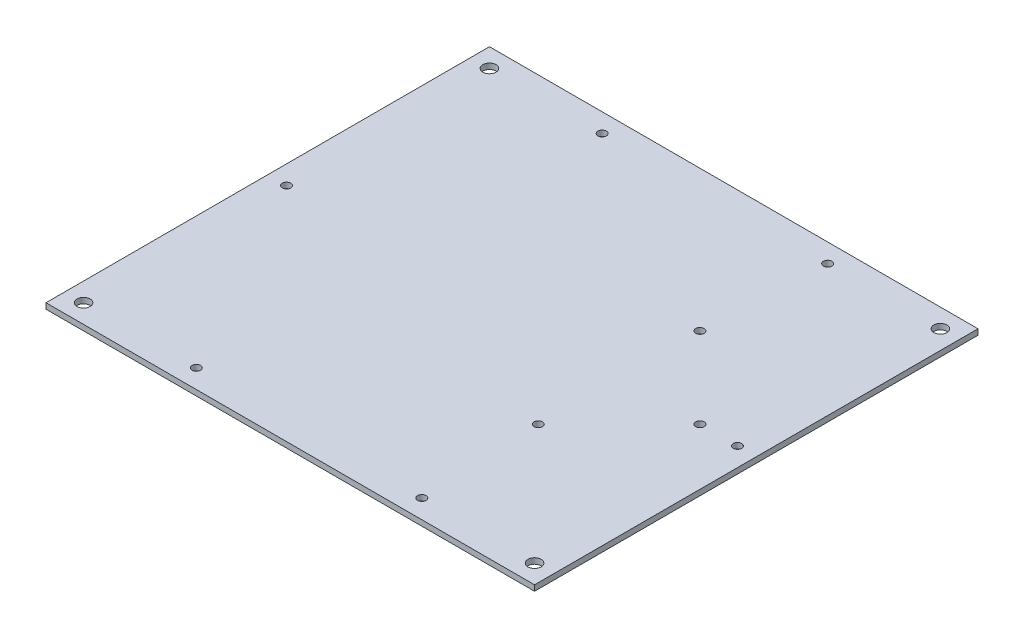
ISO-10303-21;
HEADER;
FILE_DESCRIPTION(('STEP AP214'),'2;1');
FILE_NAME('part.step','',(''),(''),'','','');
FILE_SCHEMA(('AUTOMOTIVE_DESIGN { 1 0 10303 214 1 1 1 1 }'));
ENDSEC;
DATA;
#1=APPLICATION_CONTEXT('core data for automotive mechanical design processes');
#2=APPLICATION_PROTOCOL_DEFINITION('international standard','automotive_design',2000,#1);
#3=PRODUCT_CONTEXT('',#1,'mechanical');
#4=PRODUCT('Part','Part','',(#3));
#5=PRODUCT_RELATED_PRODUCT_CATEGORY('part','',(#4));
#6=PRODUCT_DEFINITION_FORMATION('','',#4);
#7=PRODUCT_DEFINITION_CONTEXT('part definition',#1,'design');
#8=PRODUCT_DEFINITION('design','',#6,#7);
#9=PRODUCT_DEFINITION_SHAPE('','',#8);
#10=(LENGTH_UNIT() NAMED_UNIT(*) SI_UNIT(.MILLI.,.METRE.));
#11=(NAMED_UNIT(*) PLANE_ANGLE_UNIT() SI_UNIT($,.RADIAN.));
#12=(NAMED_UNIT(*) SI_UNIT($,.STERADIAN.) SOLID_ANGLE_UNIT());
#13=UNCERTAINTY_MEASURE_WITH_UNIT(LENGTH_MEASURE(1.E-05),#10,'distance_accuracy_value','');
#14=(GEOMETRIC_REPRESENTATION_CONTEXT(3) GLOBAL_UNCERTAINTY_ASSIGNED_CONTEXT((#13)) GLOBAL_UNIT_ASSIGNED_CONTEXT((#10,
#11,#12)) REPRESENTATION_CONTEXT('',''));
#15=CARTESIAN_POINT('',(0.,0.,0.));
#16=DIRECTION('',(0.,0.,1.));
#17=DIRECTION('',(1.,0.,0.));
#18=AXIS2_PLACEMENT_3D('',#15,#16,#17);
#19=CARTESIAN_POINT('',(41.0208009797823,-3.00000000000013,216.072268450656));
#20=DIRECTION('',(0.,0.,-1.));
#21=DIRECTION('',(0.,1.,0.));
#22=AXIS2_PLACEMENT_3D('',#19,#20,#21);
#23=PLANE('',#22);
#24=DIRECTION('',(-1.,0.,0.));
#25=VECTOR('',#24,1.);
#26=CARTESIAN_POINT('',(41.0208009797823,-1.33947758048002E-13,216.072268450656));
#27=LINE('',#26,#25);
#28=CARTESIAN_POINT('',(41.0208009797823,-1.33947758048002E-13,216.072268450656));
#29=VERTEX_POINT('',#28);
#30=CARTESIAN_POINT('',(-218.979199020218,7.15046319606531E-13,216.072268450656));
#31=VERTEX_POINT('',#30);
#32=EDGE_CURVE('E98',#29,#31,#27,.T.);
#33=ORIENTED_EDGE('',*,*,#32,.T.);
#34=DIRECTION('',(0.,1.,0.));
#35=VECTOR('',#34,1.);
#36=CARTESIAN_POINT('',(-218.979199020218,-2.99999999999929,216.072268450656));
#37=LINE('',#36,#35);
#38=CARTESIAN_POINT('',(-218.979199020218,-2.99999999999929,216.072268450656));
#39=VERTEX_POINT('',#38);
#40=EDGE_CURVE('E11',#39,#31,#37,.T.);
#41=ORIENTED_EDGE('',*,*,#40,.F.);
#42=DIRECTION('',(-1.,0.,0.));
#43=VECTOR('',#42,1.);
#44=CARTESIAN_POINT('',(41.0208009797823,-3.00000000000013,216.072268450656));
#45=LINE('',#44,#43);
#46=CARTESIAN_POINT('',(41.0208009797823,-3.00000000000013,216.072268450656));
#47=VERTEX_POINT('',#46);
#48=EDGE_CURVE('E86',#47,#39,#45,.T.);
#49=ORIENTED_EDGE('',*,*,#48,.F.);
#50=DIRECTION('',(0.,1.,0.));
#51=VECTOR('',#50,1.);
#52=CARTESIAN_POINT('',(41.0208009797823,-3.00000000000013,216.072268450656));
#53=LINE('',#52,#51);
#54=EDGE_CURVE('E94',#47,#29,#53,.T.);
#55=ORIENTED_EDGE('',*,*,#54,.T.);
#56=EDGE_LOOP('',(#33,#41,#49,#55));
#57=FACE_BOUND('',#56,.T.);
#58=ADVANCED_FACE('F35',(#57),#23,.F.);
#59=CARTESIAN_POINT('',(-218.979199020218,-2.99999999999929,216.072268450656));
#60=DIRECTION('',(1.,0.,0.));
#61=DIRECTION('',(0.,1.,0.));
#62=AXIS2_PLACEMENT_3D('',#59,#60,#61);
#63=PLANE('',#62);
#64=DIRECTION('',(0.,0.,-1.));
#65=VECTOR('',#64,1.);
#66=CARTESIAN_POINT('',(-218.979199020218,7.15046319606531E-13,216.072268450656));
#67=LINE('',#66,#65);
#68=CARTESIAN_POINT('',(-218.979199020218,7.1504631960653E-13,-19.9277315493439));
#69=VERTEX_POINT('',#68);
#70=EDGE_CURVE('E90',#31,#69,#67,.T.);
#71=ORIENTED_EDGE('',*,*,#70,.T.);
#72=DIRECTION('',(0.,1.,0.));
#73=VECTOR('',#72,1.);
#74=CARTESIAN_POINT('',(-218.979199020218,-2.99999999999929,-19.9277315493439));
#75=LINE('',#74,#73);
#76=CARTESIAN_POINT('',(-218.979199020218,-2.99999999999929,-19.9277315493439));
#77=VERTEX_POINT('',#76);
#78=EDGE_CURVE('E43',#77,#69,#75,.T.);
#79=ORIENTED_EDGE('',*,*,#78,.F.);
#80=DIRECTION('',(0.,0.,-1.));
#81=VECTOR('',#80,1.);
#82=CARTESIAN_POINT('',(-218.979199020218,-2.99999999999929,216.072268450656));
#83=LINE('',#82,#81);
#84=EDGE_CURVE('E81',#39,#77,#83,.T.);
#85=ORIENTED_EDGE('',*,*,#84,.F.);
#86=ORIENTED_EDGE('',*,*,#40,.T.);
#87=EDGE_LOOP('',(#71,#79,#85,#86));
#88=FACE_BOUND('',#87,.T.);
#89=ADVANCED_FACE('F89',(#88),#63,.F.);
#90=CARTESIAN_POINT('',(-218.979199020218,-2.99999999999929,-19.9277315493439));
#91=DIRECTION('',(0.,0.,1.));
#92=DIRECTION('',(1.,0.,0.));
#93=AXIS2_PLACEMENT_3D('',#90,#91,#92);
#94=PLANE('',#93);
#95=DIRECTION('',(1.,0.,0.));
#96=VECTOR('',#95,1.);
#97=CARTESIAN_POINT('',(-218.979199020218,7.1504631960653E-13,-19.9277315493439));
#98=LINE('',#97,#96);
#99=CARTESIAN_POINT('',(41.0208009797731,-1.33947758047971E-13,-19.9277315493437));
#100=VERTEX_POINT('',#99);
#101=EDGE_CURVE('E68',#69,#100,#98,.T.);
#102=ORIENTED_EDGE('',*,*,#101,.T.);
#103=DIRECTION('',(0.,1.,0.));
#104=VECTOR('',#103,1.);
#105=CARTESIAN_POINT('',(41.0208009797731,-3.00000000000013,-19.9277315493437));
#106=LINE('',#105,#104);
#107=CARTESIAN_POINT('',(41.0208009797731,-3.00000000000013,-19.9277315493437));
#108=VERTEX_POINT('',#107);
#109=EDGE_CURVE('E91',#108,#100,#106,.T.);
#110=ORIENTED_EDGE('',*,*,#109,.F.);
#111=DIRECTION('',(1.,0.,0.));
#112=VECTOR('',#111,1.);
#113=CARTESIAN_POINT('',(-218.979199020218,-2.99999999999929,-19.9277315493439));
#114=LINE('',#113,#112);
#115=EDGE_CURVE('E84',#77,#108,#114,.T.);
#116=ORIENTED_EDGE('',*,*,#115,.F.);
#117=ORIENTED_EDGE('',*,*,#78,.T.);
#118=EDGE_LOOP('',(#102,#110,#116,#117));
#119=FACE_BOUND('',#118,.T.);
#120=ADVANCED_FACE('F92',(#119),#94,.F.);
#121=CARTESIAN_POINT('',(41.0208009797731,-3.00000000000013,-19.9277315493437));
#122=DIRECTION('',(-1.,0.,0.));
#123=DIRECTION('',(0.,0.,1.));
#124=AXIS2_PLACEMENT_3D('',#121,#122,#123);
#125=PLANE('',#124);
#126=DIRECTION('',(0.,0.,1.));
#127=VECTOR('',#126,1.);
#128=CARTESIAN_POINT('',(41.0208009797731,-1.33947758047971E-13,-19.9277315493437));
#129=LINE('',#128,#127);
#130=EDGE_CURVE('E74',#100,#29,#129,.T.);
#131=ORIENTED_EDGE('',*,*,#130,.T.);
#132=ORIENTED_EDGE('',*,*,#54,.F.);
#133=DIRECTION('',(0.,0.,1.));
#134=VECTOR('',#133,1.);
#135=CARTESIAN_POINT('',(41.0208009797731,-3.00000000000013,-19.9277315493437));
#136=LINE('',#135,#134);
#137=EDGE_CURVE('E51',#108,#47,#136,.T.);
#138=ORIENTED_EDGE('',*,*,#137,.F.);
#139=ORIENTED_EDGE('',*,*,#109,.T.);
#140=EDGE_LOOP('',(#131,#132,#138,#139));
#141=FACE_BOUND('',#140,.T.);
#142=ADVANCED_FACE('F106',(#141),#125,.F.);
#143=CARTESIAN_POINT('',(0.,-3.,0.));
#144=DIRECTION('',(0.,-1.,0.));
#145=DIRECTION('',(1.,0.,0.));
#146=AXIS2_PLACEMENT_3D('',#143,#144,#145);
#147=PLANE('',#146);
#148=CARTESIAN_POINT('',(-31.9791990202268,-3.00000000000074,55.0722684506571));
#149=DIRECTION('',(0.,1.,0.));
#150=DIRECTION('',(-1.,0.,0.));
#151=AXIS2_PLACEMENT_3D('',#148,#149,#150);
#152=CIRCLE('',#151,2.25);
#153=CARTESIAN_POINT('',(-34.2291990202268,-3.00000000000074,55.0722684506571));
#154=VERTEX_POINT('',#153);
#155=EDGE_CURVE('E181',#154,#154,#152,.T.);
#156=ORIENTED_EDGE('',*,*,#155,.T.);
#157=EDGE_LOOP('',(#156));
#158=FACE_BOUND('',#157,.T.);
#159=CARTESIAN_POINT('',(11.0208009797732,-3.00000000000089,98.0722684506568));
#160=DIRECTION('',(0.,1.,0.));
#161=DIRECTION('',(-1.,0.,0.));
#162=AXIS2_PLACEMENT_3D('',#159,#160,#161);
#163=CIRCLE('',#162,2.25);
#164=CARTESIAN_POINT('',(8.77080097977317,-3.00000000000088,98.0722684506568));
#165=VERTEX_POINT('',#164);
#166=EDGE_CURVE('E175',#165,#165,#163,.T.);
#167=ORIENTED_EDGE('',*,*,#166,.T.);
#168=EDGE_LOOP('',(#167));
#169=FACE_BOUND('',#168,.T.);
#170=CARTESIAN_POINT('',(-31.9791990202268,-3.00000000000074,141.072268450657));
#171=DIRECTION('',(0.,1.,0.));
#172=DIRECTION('',(-1.,0.,0.));
#173=AXIS2_PLACEMENT_3D('',#170,#171,#172);
#174=CIRCLE('',#173,2.25);
#175=CARTESIAN_POINT('',(-34.2291990202268,-3.00000000000074,141.072268450657));
#176=VERTEX_POINT('',#175);
#177=EDGE_CURVE('E169',#176,#176,#174,.T.);
#178=ORIENTED_EDGE('',*,*,#177,.T.);
#179=EDGE_LOOP('',(#178));
#180=FACE_BOUND('',#179,.T.);
#181=CARTESIAN_POINT('',(31.0208009797823,-3.0000000000001,206.072268450656));
#182=DIRECTION('',(0.,-1.,0.));
#183=DIRECTION('',(1.,0.,0.));
#184=AXIS2_PLACEMENT_3D('',#181,#182,#183);
#185=CIRCLE('',#184,3.5);
#186=CARTESIAN_POINT('',(34.5208009797823,-3.00000000000011,206.072268450656));
#187=VERTEX_POINT('',#186);
#188=EDGE_CURVE('E166',#187,#187,#185,.T.);
#189=ORIENTED_EDGE('',*,*,#188,.F.);
#190=EDGE_LOOP('',(#189));
#191=FACE_BOUND('',#190,.T.);
#192=CARTESIAN_POINT('',(31.0208009797815,-3.0000000000001,-9.92773154934397));
#193=DIRECTION('',(0.,-1.,0.));
#194=DIRECTION('',(1.,0.,0.));
#195=AXIS2_PLACEMENT_3D('',#192,#193,#194);
#196=CIRCLE('',#195,3.5);
#197=CARTESIAN_POINT('',(34.5208009797815,-3.00000000000011,-9.92773154934397));
#198=VERTEX_POINT('',#197);
#199=EDGE_CURVE('E160',#198,#198,#196,.T.);
#200=ORIENTED_EDGE('',*,*,#199,.F.);
#201=EDGE_LOOP('',(#200));
#202=FACE_BOUND('',#201,.T.);
#203=CARTESIAN_POINT('',(-208.979199020218,-2.99999999999932,206.072268450656));
#204=DIRECTION('',(0.,-1.,0.));
#205=DIRECTION('',(1.,0.,0.));
#206=AXIS2_PLACEMENT_3D('',#203,#204,#205);
#207=CIRCLE('',#206,3.50000000000002);
#208=CARTESIAN_POINT('',(-205.479199020218,-2.99999999999933,206.072268450656));
#209=VERTEX_POINT('',#208);
#210=EDGE_CURVE('E154',#209,#209,#207,.T.);
#211=ORIENTED_EDGE('',*,*,#210,.F.);
#212=EDGE_LOOP('',(#211));
#213=FACE_BOUND('',#212,.T.);
#214=CARTESIAN_POINT('',(-208.979199020217,-2.99999999999932,-9.92773154934397));
#215=DIRECTION('',(0.,-1.,0.));
#216=DIRECTION('',(1.,0.,0.));
#217=AXIS2_PLACEMENT_3D('',#214,#215,#216);
#218=CIRCLE('',#217,3.50000000000002);
#219=CARTESIAN_POINT('',(-205.479199020217,-2.99999999999933,-9.92773154934397));
#220=VERTEX_POINT('',#219);
#221=EDGE_CURVE('E148',#220,#220,#218,.T.);
#222=ORIENTED_EDGE('',*,*,#221,.F.);
#223=EDGE_LOOP('',(#222));
#224=FACE_BOUND('',#223,.T.);
#225=CARTESIAN_POINT('',(-148.979199020218,-2.99999999999951,206.072268450656));
#226=DIRECTION('',(0.,-1.,0.));
#227=DIRECTION('',(1.,0.,0.));
#228=AXIS2_PLACEMENT_3D('',#225,#226,#227);
#229=CIRCLE('',#228,2.24999999999995);
#230=CARTESIAN_POINT('',(-146.729199020218,-2.99999999999952,206.072268450656));
#231=VERTEX_POINT('',#230);
#232=EDGE_CURVE('E142',#231,#231,#229,.T.);
#233=ORIENTED_EDGE('',*,*,#232,.F.);
#234=EDGE_LOOP('',(#233));
#235=FACE_BOUND('',#234,.T.);
#236=CARTESIAN_POINT('',(-28.9791990202177,-2.99999999999991,206.072268450656));
#237=DIRECTION('',(0.,-1.,0.));
#238=DIRECTION('',(1.,0.,0.));
#239=AXIS2_PLACEMENT_3D('',#236,#237,#238);
#240=CIRCLE('',#239,2.25);
#241=CARTESIAN_POINT('',(-26.7291990202177,-2.99999999999991,206.072268450656));
#242=VERTEX_POINT('',#241);
#243=EDGE_CURVE('E136',#242,#242,#240,.T.);
#244=ORIENTED_EDGE('',*,*,#243,.F.);
#245=EDGE_LOOP('',(#244));
#246=FACE_BOUND('',#245,.T.);
#247=CARTESIAN_POINT('',(31.0208009797823,-3.0000000000001,98.0722684506568));
#248=DIRECTION('',(0.,-1.,0.));
#249=DIRECTION('',(1.,0.,0.));
#250=AXIS2_PLACEMENT_3D('',#247,#248,#249);
#251=CIRCLE('',#250,2.25000000000001);
#252=CARTESIAN_POINT('',(33.2708009797823,-3.00000000000011,98.0722684506568));
#253=VERTEX_POINT('',#252);
#254=EDGE_CURVE('E130',#253,#253,#251,.T.);
#255=ORIENTED_EDGE('',*,*,#254,.F.);
#256=EDGE_LOOP('',(#255));
#257=FACE_BOUND('',#256,.T.);
#258=CARTESIAN_POINT('',(-28.9791990202185,-2.99999999999991,-9.92773154934397));
#259=DIRECTION('',(0.,-1.,0.));
#260=DIRECTION('',(1.,0.,0.));
#261=AXIS2_PLACEMENT_3D('',#258,#259,#260);
#262=CIRCLE('',#261,2.25);
#263=CARTESIAN_POINT('',(-26.7291990202185,-2.99999999999991,-9.92773154934397));
#264=VERTEX_POINT('',#263);
#265=EDGE_CURVE('E124',#264,#264,#262,.T.);
#266=ORIENTED_EDGE('',*,*,#265,.F.);
#267=EDGE_LOOP('',(#266));
#268=FACE_BOUND('',#267,.T.);
#269=CARTESIAN_POINT('',(-148.979199020217,-2.99999999999951,-9.9277315493427));
#270=DIRECTION('',(0.,-1.,0.));
#271=DIRECTION('',(1.,0.,0.));
#272=AXIS2_PLACEMENT_3D('',#269,#270,#271);
#273=CIRCLE('',#272,2.24999999999995);
#274=CARTESIAN_POINT('',(-146.729199020218,-2.99999999999952,-9.9277315493427));
#275=VERTEX_POINT('',#274);
#276=EDGE_CURVE('E118',#275,#275,#273,.T.);
#277=ORIENTED_EDGE('',*,*,#276,.F.);
#278=EDGE_LOOP('',(#277));
#279=FACE_BOUND('',#278,.T.);
#280=CARTESIAN_POINT('',(-208.979199020218,-2.99999999999932,98.0722684506568));
#281=DIRECTION('',(0.,-1.,0.));
#282=DIRECTION('',(1.,0.,0.));
#283=AXIS2_PLACEMENT_3D('',#280,#281,#282);
#284=CIRCLE('',#283,2.24999999999995);
#285=CARTESIAN_POINT('',(-206.729199020218,-2.99999999999933,98.0722684506568));
#286=VERTEX_POINT('',#285);
#287=EDGE_CURVE('E112',#286,#286,#284,.T.);
#288=ORIENTED_EDGE('',*,*,#287,.F.);
#289=EDGE_LOOP('',(#288));
#290=FACE_BOUND('',#289,.T.);
#291=ORIENTED_EDGE('',*,*,#48,.T.);
#292=ORIENTED_EDGE('',*,*,#84,.T.);
#293=ORIENTED_EDGE('',*,*,#115,.T.);
#294=ORIENTED_EDGE('',*,*,#137,.T.);
#295=EDGE_LOOP('',(#291,#292,#293,#294));
#296=FACE_BOUND('',#295,.T.);
#297=ADVANCED_FACE('F82',(#158,#169,#180,#191,#202,#213,#224,#235,#246,#257,#268,#279,#290,
#296),#147,.T.);
#298=CARTESIAN_POINT('',(0.,0.,0.));
#299=DIRECTION('',(0.,-1.,0.));
#300=DIRECTION('',(1.,0.,0.));
#301=AXIS2_PLACEMENT_3D('',#298,#299,#300);
#302=PLANE('',#301);
#303=CARTESIAN_POINT('',(-31.9791990202268,1.04423656062724E-13,55.0722684506571));
#304=DIRECTION('',(0.,1.,0.));
#305=DIRECTION('',(-1.,0.,0.));
#306=AXIS2_PLACEMENT_3D('',#303,#304,#305);
#307=CIRCLE('',#306,2.25);
#308=CARTESIAN_POINT('',(-34.2291990202268,1.11770720196273E-13,55.0722684506571));
#309=VERTEX_POINT('',#308);
#310=EDGE_CURVE('E184',#309,#309,#307,.T.);
#311=ORIENTED_EDGE('',*,*,#310,.F.);
#312=EDGE_LOOP('',(#311));
#313=FACE_BOUND('',#312,.T.);
#314=CARTESIAN_POINT('',(11.0208009797732,0.,98.0722684506568));
#315=DIRECTION('',(0.,1.,0.));
#316=DIRECTION('',(-1.,0.,0.));
#317=AXIS2_PLACEMENT_3D('',#314,#315,#316);
#318=CIRCLE('',#317,2.25);
#319=CARTESIAN_POINT('',(8.77080097977318,0.,98.0722684506568));
#320=VERTEX_POINT('',#319);
#321=EDGE_CURVE('E178',#320,#320,#318,.T.);
#322=ORIENTED_EDGE('',*,*,#321,.F.);
#323=EDGE_LOOP('',(#322));
#324=FACE_BOUND('',#323,.T.);
#325=CARTESIAN_POINT('',(-31.9791990202268,1.04423656062724E-13,141.072268450657));
#326=DIRECTION('',(0.,1.,0.));
#327=DIRECTION('',(-1.,0.,0.));
#328=AXIS2_PLACEMENT_3D('',#325,#326,#327);
#329=CIRCLE('',#328,2.25);
#330=CARTESIAN_POINT('',(-34.2291990202268,1.11770720196272E-13,141.072268450657));
#331=VERTEX_POINT('',#330);
#332=EDGE_CURVE('E172',#331,#331,#329,.T.);
#333=ORIENTED_EDGE('',*,*,#332,.F.);
#334=EDGE_LOOP('',(#333));
#335=FACE_BOUND('',#334,.T.);
#336=CARTESIAN_POINT('',(31.0208009797823,7.47665818146004E-13,206.072268450656));
#337=DIRECTION('',(0.,-1.,0.));
#338=DIRECTION('',(1.,0.,0.));
#339=AXIS2_PLACEMENT_3D('',#336,#337,#338);
#340=CIRCLE('',#339,3.5);
#341=CARTESIAN_POINT('',(34.5208009797823,7.36237051716039E-13,206.072268450656));
#342=VERTEX_POINT('',#341);
#343=EDGE_CURVE('E163',#342,#342,#340,.T.);
#344=ORIENTED_EDGE('',*,*,#343,.T.);
#345=EDGE_LOOP('',(#344));
#346=FACE_BOUND('',#345,.T.);
#347=CARTESIAN_POINT('',(31.0208009797815,7.47665818146004E-13,-9.92773154934397));
#348=DIRECTION('',(0.,-1.,0.));
#349=DIRECTION('',(1.,0.,0.));
#350=AXIS2_PLACEMENT_3D('',#347,#348,#349);
#351=CIRCLE('',#350,3.5);
#352=CARTESIAN_POINT('',(34.5208009797815,7.36237051716039E-13,-9.92773154934397));
#353=VERTEX_POINT('',#352);
#354=EDGE_CURVE('E157',#353,#353,#351,.T.);
#355=ORIENTED_EDGE('',*,*,#354,.T.);
#356=EDGE_LOOP('',(#355));
#357=FACE_BOUND('',#356,.T.);
#358=CARTESIAN_POINT('',(-208.979199020218,1.53132714841853E-12,206.072268450656));
#359=DIRECTION('',(0.,-1.,0.));
#360=DIRECTION('',(1.,0.,0.));
#361=AXIS2_PLACEMENT_3D('',#358,#359,#360);
#362=CIRCLE('',#361,3.50000000000002);
#363=CARTESIAN_POINT('',(-205.479199020218,1.51989838198856E-12,206.072268450656));
#364=VERTEX_POINT('',#363);
#365=EDGE_CURVE('E151',#364,#364,#362,.T.);
#366=ORIENTED_EDGE('',*,*,#365,.T.);
#367=EDGE_LOOP('',(#366));
#368=FACE_BOUND('',#367,.T.);
#369=CARTESIAN_POINT('',(-208.979199020217,1.53132714841853E-12,-9.92773154934397));
#370=DIRECTION('',(0.,-1.,0.));
#371=DIRECTION('',(1.,0.,0.));
#372=AXIS2_PLACEMENT_3D('',#369,#370,#371);
#373=CIRCLE('',#372,3.50000000000002);
#374=CARTESIAN_POINT('',(-205.479199020217,1.51989838198856E-12,-9.92773154934397));
#375=VERTEX_POINT('',#374);
#376=EDGE_CURVE('E145',#375,#375,#373,.T.);
#377=ORIENTED_EDGE('',*,*,#376,.T.);
#378=EDGE_LOOP('',(#377));
#379=FACE_BOUND('',#378,.T.);
#380=CARTESIAN_POINT('',(-148.979199020218,1.33573707650214E-12,206.072268450656));
#381=DIRECTION('',(0.,-1.,0.));
#382=DIRECTION('',(1.,0.,0.));
#383=AXIS2_PLACEMENT_3D('',#380,#381,#382);
#384=CIRCLE('',#383,2.24999999999995);
#385=CARTESIAN_POINT('',(-146.729199020218,1.32839001236859E-12,206.072268450656));
#386=VERTEX_POINT('',#385);
#387=EDGE_CURVE('E139',#386,#386,#384,.T.);
#388=ORIENTED_EDGE('',*,*,#387,.T.);
#389=EDGE_LOOP('',(#388));
#390=FACE_BOUND('',#389,.T.);
#391=CARTESIAN_POINT('',(-28.9791990202177,9.43689570931383E-13,206.072268450656));
#392=DIRECTION('',(0.,-1.,0.));
#393=DIRECTION('',(1.,0.,0.));
#394=AXIS2_PLACEMENT_3D('',#391,#392,#393);
#395=CIRCLE('',#394,2.25);
#396=CARTESIAN_POINT('',(-26.7291990202177,9.36342506797834E-13,206.072268450656));
#397=VERTEX_POINT('',#396);
#398=EDGE_CURVE('E133',#397,#397,#395,.T.);
#399=ORIENTED_EDGE('',*,*,#398,.T.);
#400=EDGE_LOOP('',(#399));
#401=FACE_BOUND('',#400,.T.);
#402=CARTESIAN_POINT('',(31.0208009797823,7.47665818146004E-13,98.0722684506568));
#403=DIRECTION('',(0.,-1.,0.));
#404=DIRECTION('',(1.,0.,0.));
#405=AXIS2_PLACEMENT_3D('',#402,#403,#404);
#406=CIRCLE('',#405,2.25000000000001);
#407=CARTESIAN_POINT('',(33.2708009797823,7.40318754012455E-13,98.0722684506568));
#408=VERTEX_POINT('',#407);
#409=EDGE_CURVE('E127',#408,#408,#406,.T.);
#410=ORIENTED_EDGE('',*,*,#409,.T.);
#411=EDGE_LOOP('',(#410));
#412=FACE_BOUND('',#411,.T.);
#413=CARTESIAN_POINT('',(-28.9791990202185,9.43689570931383E-13,-9.92773154934397));
#414=DIRECTION('',(0.,-1.,0.));
#415=DIRECTION('',(1.,0.,0.));
#416=AXIS2_PLACEMENT_3D('',#413,#414,#415);
#417=CIRCLE('',#416,2.25);
#418=CARTESIAN_POINT('',(-26.7291990202185,9.36342506797834E-13,-9.92773154934397));
#419=VERTEX_POINT('',#418);
#420=EDGE_CURVE('E121',#419,#419,#417,.T.);
#421=ORIENTED_EDGE('',*,*,#420,.T.);
#422=EDGE_LOOP('',(#421));
#423=FACE_BOUND('',#422,.T.);
#424=CARTESIAN_POINT('',(-148.979199020217,1.33573707650214E-12,-9.9277315493427));
#425=DIRECTION('',(0.,-1.,0.));
#426=DIRECTION('',(1.,0.,0.));
#427=AXIS2_PLACEMENT_3D('',#424,#425,#426);
#428=CIRCLE('',#427,2.24999999999995);
#429=CARTESIAN_POINT('',(-146.729199020218,1.32839001236859E-12,-9.9277315493427));
#430=VERTEX_POINT('',#429);
#431=EDGE_CURVE('E115',#430,#430,#428,.T.);
#432=ORIENTED_EDGE('',*,*,#431,.T.);
#433=EDGE_LOOP('',(#432));
#434=FACE_BOUND('',#433,.T.);
#435=CARTESIAN_POINT('',(-208.979199020218,1.53132714841853E-12,98.0722684506568));
#436=DIRECTION('',(0.,-1.,0.));
#437=DIRECTION('',(1.,0.,0.));
#438=AXIS2_PLACEMENT_3D('',#435,#436,#437);
#439=CIRCLE('',#438,2.24999999999995);
#440=CARTESIAN_POINT('',(-206.729199020218,1.52398008428498E-12,98.0722684506568));
#441=VERTEX_POINT('',#440);
#442=EDGE_CURVE('E101',#441,#441,#439,.T.);
#443=ORIENTED_EDGE('',*,*,#442,.T.);
#444=EDGE_LOOP('',(#443));
#445=FACE_BOUND('',#444,.T.);
#446=ORIENTED_EDGE('',*,*,#32,.F.);
#447=ORIENTED_EDGE('',*,*,#130,.F.);
#448=ORIENTED_EDGE('',*,*,#101,.F.);
#449=ORIENTED_EDGE('',*,*,#70,.F.);
#450=EDGE_LOOP('',(#446,#447,#448,#449));
#451=FACE_BOUND('',#450,.T.);
#452=ADVANCED_FACE('F109',(#313,#324,#335,#346,#357,#368,#379,#390,#401,#412,#423,#434,#445,
#451),#302,.F.);
#453=CARTESIAN_POINT('',(-208.979199020218,1.53132714841853E-12,98.0722684506568));
#454=DIRECTION('',(0.,-1.,0.));
#455=DIRECTION('',(1.,0.,0.));
#456=AXIS2_PLACEMENT_3D('',#453,#454,#455);
#457=CYLINDRICAL_SURFACE('',#456,2.24999999999995);
#458=ORIENTED_EDGE('',*,*,#442,.F.);
#459=EDGE_LOOP('',(#458));
#460=FACE_BOUND('',#459,.T.);
#461=ORIENTED_EDGE('',*,*,#287,.T.);
#462=EDGE_LOOP('',(#461));
#463=FACE_BOUND('',#462,.T.);
#464=ADVANCED_FACE('F201',(#460,#463),#457,.F.);
#465=CARTESIAN_POINT('',(-148.979199020217,1.33573707650214E-12,-9.9277315493427));
#466=DIRECTION('',(0.,-1.,0.));
#467=DIRECTION('',(1.,0.,0.));
#468=AXIS2_PLACEMENT_3D('',#465,#466,#467);
#469=CYLINDRICAL_SURFACE('',#468,2.24999999999995);
#470=ORIENTED_EDGE('',*,*,#431,.F.);
#471=EDGE_LOOP('',(#470));
#472=FACE_BOUND('',#471,.T.);
#473=ORIENTED_EDGE('',*,*,#276,.T.);
#474=EDGE_LOOP('',(#473));
#475=FACE_BOUND('',#474,.T.);
#476=ADVANCED_FACE('F229',(#472,#475),#469,.F.);
#477=CARTESIAN_POINT('',(-28.9791990202185,9.43689570931383E-13,-9.92773154934397));
#478=DIRECTION('',(0.,-1.,0.));
#479=DIRECTION('',(1.,0.,0.));
#480=AXIS2_PLACEMENT_3D('',#477,#478,#479);
#481=CYLINDRICAL_SURFACE('',#480,2.25);
#482=ORIENTED_EDGE('',*,*,#420,.F.);
#483=EDGE_LOOP('',(#482));
#484=FACE_BOUND('',#483,.T.);
#485=ORIENTED_EDGE('',*,*,#265,.T.);
#486=EDGE_LOOP('',(#485));
#487=FACE_BOUND('',#486,.T.);
#488=ADVANCED_FACE('F275',(#484,#487),#481,.F.);
#489=CARTESIAN_POINT('',(31.0208009797823,7.47665818146004E-13,98.0722684506568));
#490=DIRECTION('',(0.,-1.,0.));
#491=DIRECTION('',(1.,0.,0.));
#492=AXIS2_PLACEMENT_3D('',#489,#490,#491);
#493=CYLINDRICAL_SURFACE('',#492,2.25000000000001);
#494=ORIENTED_EDGE('',*,*,#409,.F.);
#495=EDGE_LOOP('',(#494));
#496=FACE_BOUND('',#495,.T.);
#497=ORIENTED_EDGE('',*,*,#254,.T.);
#498=EDGE_LOOP('',(#497));
#499=FACE_BOUND('',#498,.T.);
#500=ADVANCED_FACE('F283',(#496,#499),#493,.F.);
#501=CARTESIAN_POINT('',(-28.9791990202177,9.43689570931383E-13,206.072268450656));
#502=DIRECTION('',(0.,-1.,0.));
#503=DIRECTION('',(1.,0.,0.));
#504=AXIS2_PLACEMENT_3D('',#501,#502,#503);
#505=CYLINDRICAL_SURFACE('',#504,2.25);
#506=ORIENTED_EDGE('',*,*,#398,.F.);
#507=EDGE_LOOP('',(#506));
#508=FACE_BOUND('',#507,.T.);
#509=ORIENTED_EDGE('',*,*,#243,.T.);
#510=EDGE_LOOP('',(#509));
#511=FACE_BOUND('',#510,.T.);
#512=ADVANCED_FACE('F291',(#508,#511),#505,.F.);
#513=CARTESIAN_POINT('',(-148.979199020218,1.33573707650214E-12,206.072268450656));
#514=DIRECTION('',(0.,-1.,0.));
#515=DIRECTION('',(1.,0.,0.));
#516=AXIS2_PLACEMENT_3D('',#513,#514,#515);
#517=CYLINDRICAL_SURFACE('',#516,2.24999999999995);
#518=ORIENTED_EDGE('',*,*,#387,.F.);
#519=EDGE_LOOP('',(#518));
#520=FACE_BOUND('',#519,.T.);
#521=ORIENTED_EDGE('',*,*,#232,.T.);
#522=EDGE_LOOP('',(#521));
#523=FACE_BOUND('',#522,.T.);
#524=ADVANCED_FACE('F299',(#520,#523),#517,.F.);
#525=CARTESIAN_POINT('',(-208.979199020217,1.53132714841853E-12,-9.92773154934397));
#526=DIRECTION('',(0.,-1.,0.));
#527=DIRECTION('',(1.,0.,0.));
#528=AXIS2_PLACEMENT_3D('',#525,#526,#527);
#529=CYLINDRICAL_SURFACE('',#528,3.50000000000002);
#530=ORIENTED_EDGE('',*,*,#376,.F.);
#531=EDGE_LOOP('',(#530));
#532=FACE_BOUND('',#531,.T.);
#533=ORIENTED_EDGE('',*,*,#221,.T.);
#534=EDGE_LOOP('',(#533));
#535=FACE_BOUND('',#534,.T.);
#536=ADVANCED_FACE('F307',(#532,#535),#529,.F.);
#537=CARTESIAN_POINT('',(-208.979199020218,1.53132714841853E-12,206.072268450656));
#538=DIRECTION('',(0.,-1.,0.));
#539=DIRECTION('',(1.,0.,0.));
#540=AXIS2_PLACEMENT_3D('',#537,#538,#539);
#541=CYLINDRICAL_SURFACE('',#540,3.50000000000002);
#542=ORIENTED_EDGE('',*,*,#365,.F.);
#543=EDGE_LOOP('',(#542));
#544=FACE_BOUND('',#543,.T.);
#545=ORIENTED_EDGE('',*,*,#210,.T.);
#546=EDGE_LOOP('',(#545));
#547=FACE_BOUND('',#546,.T.);
#548=ADVANCED_FACE('F315',(#544,#547),#541,.F.);
#549=CARTESIAN_POINT('',(31.0208009797815,7.47665818146004E-13,-9.92773154934397));
#550=DIRECTION('',(0.,-1.,0.));
#551=DIRECTION('',(1.,0.,0.));
#552=AXIS2_PLACEMENT_3D('',#549,#550,#551);
#553=CYLINDRICAL_SURFACE('',#552,3.5);
#554=ORIENTED_EDGE('',*,*,#354,.F.);
#555=EDGE_LOOP('',(#554));
#556=FACE_BOUND('',#555,.T.);
#557=ORIENTED_EDGE('',*,*,#199,.T.);
#558=EDGE_LOOP('',(#557));
#559=FACE_BOUND('',#558,.T.);
#560=ADVANCED_FACE('F323',(#556,#559),#553,.F.);
#561=CARTESIAN_POINT('',(31.0208009797823,7.47665818146004E-13,206.072268450656));
#562=DIRECTION('',(0.,-1.,0.));
#563=DIRECTION('',(1.,0.,0.));
#564=AXIS2_PLACEMENT_3D('',#561,#562,#563);
#565=CYLINDRICAL_SURFACE('',#564,3.5);
#566=ORIENTED_EDGE('',*,*,#343,.F.);
#567=EDGE_LOOP('',(#566));
#568=FACE_BOUND('',#567,.T.);
#569=ORIENTED_EDGE('',*,*,#188,.T.);
#570=EDGE_LOOP('',(#569));
#571=FACE_BOUND('',#570,.T.);
#572=ADVANCED_FACE('F331',(#568,#571),#565,.F.);
#573=CARTESIAN_POINT('',(-31.9791990202268,-3.00000000000074,141.072268450657));
#574=DIRECTION('',(0.,1.,0.));
#575=DIRECTION('',(-1.,0.,0.));
#576=AXIS2_PLACEMENT_3D('',#573,#574,#575);
#577=CYLINDRICAL_SURFACE('',#576,2.25);
#578=ORIENTED_EDGE('',*,*,#177,.F.);
#579=EDGE_LOOP('',(#578));
#580=FACE_BOUND('',#579,.T.);
#581=ORIENTED_EDGE('',*,*,#332,.T.);
#582=EDGE_LOOP('',(#581));
#583=FACE_BOUND('',#582,.T.);
#584=ADVANCED_FACE('F338',(#580,#583),#577,.F.);
#585=CARTESIAN_POINT('',(11.0208009797732,-3.00000000000089,98.0722684506568));
#586=DIRECTION('',(0.,1.,0.));
#587=DIRECTION('',(-1.,0.,0.));
#588=AXIS2_PLACEMENT_3D('',#585,#586,#587);
#589=CYLINDRICAL_SURFACE('',#588,2.25);
#590=ORIENTED_EDGE('',*,*,#166,.F.);
#591=EDGE_LOOP('',(#590));
#592=FACE_BOUND('',#591,.T.);
#593=ORIENTED_EDGE('',*,*,#321,.T.);
#594=EDGE_LOOP('',(#593));
#595=FACE_BOUND('',#594,.T.);
#596=ADVANCED_FACE('F195',(#592,#595),#589,.F.);
#597=CARTESIAN_POINT('',(-31.9791990202268,-3.00000000000074,55.0722684506571));
#598=DIRECTION('',(0.,1.,0.));
#599=DIRECTION('',(-1.,0.,0.));
#600=AXIS2_PLACEMENT_3D('',#597,#598,#599);
#601=CYLINDRICAL_SURFACE('',#600,2.25);
#602=ORIENTED_EDGE('',*,*,#155,.F.);
#603=EDGE_LOOP('',(#602));
#604=FACE_BOUND('',#603,.T.);
#605=ORIENTED_EDGE('',*,*,#310,.T.);
#606=EDGE_LOOP('',(#605));
#607=FACE_BOUND('',#606,.T.);
#608=ADVANCED_FACE('F192',(#604,#607),#601,.F.);
#609=CLOSED_SHELL('',(#58,#89,#120,#142,#297,#452,#464,#476,#488,#500,#512,#524,#536,#548,#560,
#572,#584,#596,#608));
#610=MANIFOLD_SOLID_BREP('B2',#609);
#611=ADVANCED_BREP_SHAPE_REPRESENTATION('',(#18,#610),#14);
#612=SHAPE_DEFINITION_REPRESENTATION(#9,#611);
ENDSEC;
END-ISO-10303-21;
